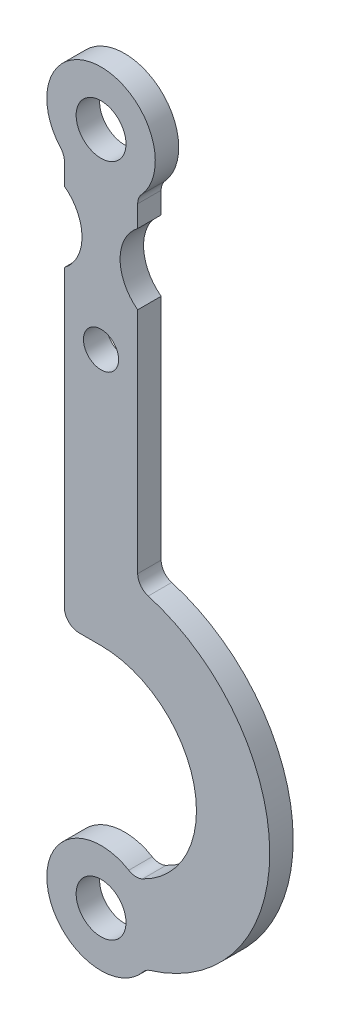
ISO-10303-21;
HEADER;
FILE_DESCRIPTION(('STEP AP214'),'2;1');
FILE_NAME('part.step','',(''),(''),'','','');
FILE_SCHEMA(('AUTOMOTIVE_DESIGN { 1 0 10303 214 1 1 1 1 }'));
ENDSEC;
DATA;
#1=APPLICATION_CONTEXT('core data for automotive mechanical design processes');
#2=APPLICATION_PROTOCOL_DEFINITION('international standard','automotive_design',2000,#1);
#3=PRODUCT_CONTEXT('',#1,'mechanical');
#4=PRODUCT('Part','Part','',(#3));
#5=PRODUCT_RELATED_PRODUCT_CATEGORY('part','',(#4));
#6=PRODUCT_DEFINITION_FORMATION('','',#4);
#7=PRODUCT_DEFINITION_CONTEXT('part definition',#1,'design');
#8=PRODUCT_DEFINITION('design','',#6,#7);
#9=PRODUCT_DEFINITION_SHAPE('','',#8);
#10=(LENGTH_UNIT() NAMED_UNIT(*) SI_UNIT(.MILLI.,.METRE.));
#11=(NAMED_UNIT(*) PLANE_ANGLE_UNIT() SI_UNIT($,.RADIAN.));
#12=(NAMED_UNIT(*) SI_UNIT($,.STERADIAN.) SOLID_ANGLE_UNIT());
#13=UNCERTAINTY_MEASURE_WITH_UNIT(LENGTH_MEASURE(1.E-05),#10,'distance_accuracy_value','');
#14=(GEOMETRIC_REPRESENTATION_CONTEXT(3) GLOBAL_UNCERTAINTY_ASSIGNED_CONTEXT((#13)) GLOBAL_UNIT_ASSIGNED_CONTEXT((#10,
#11,#12)) REPRESENTATION_CONTEXT('',''));
#15=CARTESIAN_POINT('',(0.,0.,0.));
#16=DIRECTION('',(0.,0.,1.));
#17=DIRECTION('',(1.,0.,0.));
#18=AXIS2_PLACEMENT_3D('',#15,#16,#17);
#19=CARTESIAN_POINT('',(0.,-230.,8.));
#20=DIRECTION('',(0.,0.,-1.));
#21=DIRECTION('',(-1.,0.,0.));
#22=AXIS2_PLACEMENT_3D('',#19,#20,#21);
#23=CYLINDRICAL_SURFACE('',#22,18.5);
#24=CARTESIAN_POINT('',(0.,-230.,0.));
#25=DIRECTION('',(0.,0.,1.));
#26=DIRECTION('',(1.,0.,0.));
#27=AXIS2_PLACEMENT_3D('',#24,#25,#26);
#28=CIRCLE('',#27,18.5);
#29=CARTESIAN_POINT('',(9.44463891587366,-214.092492472145,0.));
#30=VERTEX_POINT('',#29);
#31=CARTESIAN_POINT('',(14.3530284553606,-241.672213764304,0.));
#32=VERTEX_POINT('',#31);
#33=EDGE_CURVE('E220',#30,#32,#28,.T.);
#34=ORIENTED_EDGE('',*,*,#33,.T.);
#35=DIRECTION('',(0.,0.,-1.));
#36=VECTOR('',#35,1.);
#37=CARTESIAN_POINT('',(14.3530284553606,-241.672213764304,8.));
#38=LINE('',#37,#36);
#39=CARTESIAN_POINT('',(14.3530284553606,-241.672213764304,8.));
#40=VERTEX_POINT('',#39);
#41=EDGE_CURVE('E261',#32,#40,#38,.F.);
#42=ORIENTED_EDGE('',*,*,#41,.T.);
#43=CARTESIAN_POINT('',(0.,-230.,8.));
#44=DIRECTION('',(0.,0.,1.));
#45=DIRECTION('',(1.,0.,0.));
#46=AXIS2_PLACEMENT_3D('',#43,#44,#45);
#47=CIRCLE('',#46,18.5);
#48=CARTESIAN_POINT('',(9.44463891587366,-214.092492472145,8.));
#49=VERTEX_POINT('',#48);
#50=EDGE_CURVE('E387',#49,#40,#47,.T.);
#51=ORIENTED_EDGE('',*,*,#50,.F.);
#52=DIRECTION('',(0.,0.,-1.));
#53=VECTOR('',#52,1.);
#54=CARTESIAN_POINT('',(9.44463891587366,-214.092492472145,8.));
#55=LINE('',#54,#53);
#56=EDGE_CURVE('E258',#49,#30,#55,.T.);
#57=ORIENTED_EDGE('',*,*,#56,.T.);
#58=EDGE_LOOP('',(#34,#42,#51,#57));
#59=FACE_BOUND('',#58,.T.);
#60=ADVANCED_FACE('F43',(#59),#23,.T.);
#61=CARTESIAN_POINT('',(0.,-185.,8.));
#62=DIRECTION('',(0.,0.,-1.));
#63=DIRECTION('',(-1.,0.,0.));
#64=AXIS2_PLACEMENT_3D('',#61,#62,#63);
#65=CYLINDRICAL_SURFACE('',#64,57.5433285968466);
#66=CARTESIAN_POINT('',(0.,-185.,8.));
#67=DIRECTION('',(0.,0.,1.));
#68=DIRECTION('',(1.,0.,0.));
#69=AXIS2_PLACEMENT_3D('',#66,#67,#68);
#70=CIRCLE('',#69,57.5433285968466);
#71=CARTESIAN_POINT('',(16.7746577780857,-240.044032577862,8.));
#72=VERTEX_POINT('',#71);
#73=CARTESIAN_POINT('',(16.1009698881871,-129.755150152577,8.));
#74=VERTEX_POINT('',#73);
#75=EDGE_CURVE('E185',#72,#74,#70,.T.);
#76=ORIENTED_EDGE('',*,*,#75,.F.);
#77=DIRECTION('',(0.,0.,-1.));
#78=VECTOR('',#77,1.);
#79=CARTESIAN_POINT('',(16.7746577780857,-240.044032577862,8.));
#80=LINE('',#79,#78);
#81=CARTESIAN_POINT('',(16.7746577780857,-240.044032577862,0.));
#82=VERTEX_POINT('',#81);
#83=EDGE_CURVE('E255',#72,#82,#80,.T.);
#84=ORIENTED_EDGE('',*,*,#83,.T.);
#85=CARTESIAN_POINT('',(0.,-185.,0.));
#86=DIRECTION('',(0.,0.,1.));
#87=DIRECTION('',(1.,0.,0.));
#88=AXIS2_PLACEMENT_3D('',#85,#86,#87);
#89=CIRCLE('',#88,57.5433285968466);
#90=CARTESIAN_POINT('',(16.1009698881871,-129.755150152577,0.));
#91=VERTEX_POINT('',#90);
#92=EDGE_CURVE('E223',#82,#91,#89,.T.);
#93=ORIENTED_EDGE('',*,*,#92,.T.);
#94=DIRECTION('',(0.,0.,-1.));
#95=VECTOR('',#94,1.);
#96=CARTESIAN_POINT('',(16.1009698881871,-129.755150152577,8.));
#97=LINE('',#96,#95);
#98=EDGE_CURVE('E175',#91,#74,#97,.F.);
#99=ORIENTED_EDGE('',*,*,#98,.T.);
#100=EDGE_LOOP('',(#76,#84,#93,#99));
#101=FACE_BOUND('',#100,.T.);
#102=ADVANCED_FACE('F305',(#101),#65,.T.);
#103=CARTESIAN_POINT('',(12.5,0.,8.));
#104=DIRECTION('',(1.,0.,0.));
#105=DIRECTION('',(0.,1.,0.));
#106=AXIS2_PLACEMENT_3D('',#103,#104,#105);
#107=PLANE('',#106);
#108=DIRECTION('',(0.,-1.,0.));
#109=VECTOR('',#108,1.);
#110=CARTESIAN_POINT('',(12.5,0.,8.));
#111=LINE('',#110,#109);
#112=CARTESIAN_POINT('',(12.5,-47.,8.));
#113=VERTEX_POINT('',#112);
#114=CARTESIAN_POINT('',(12.5,-124.954867374839,8.));
#115=VERTEX_POINT('',#114);
#116=EDGE_CURVE('E167',#113,#115,#111,.T.);
#117=ORIENTED_EDGE('',*,*,#116,.T.);
#118=DIRECTION('',(0.,0.,-1.));
#119=VECTOR('',#118,1.);
#120=CARTESIAN_POINT('',(12.5,-124.954867374839,8.));
#121=LINE('',#120,#119);
#122=CARTESIAN_POINT('',(12.5,-124.954867374839,0.));
#123=VERTEX_POINT('',#122);
#124=EDGE_CURVE('E275',#115,#123,#121,.T.);
#125=ORIENTED_EDGE('',*,*,#124,.T.);
#126=DIRECTION('',(0.,-1.,0.));
#127=VECTOR('',#126,1.);
#128=CARTESIAN_POINT('',(12.5,0.,0.));
#129=LINE('',#128,#127);
#130=CARTESIAN_POINT('',(12.5,-47.,0.));
#131=VERTEX_POINT('',#130);
#132=EDGE_CURVE('E170',#131,#123,#129,.T.);
#133=ORIENTED_EDGE('',*,*,#132,.F.);
#134=DIRECTION('',(0.,0.,-1.));
#135=VECTOR('',#134,1.);
#136=CARTESIAN_POINT('',(12.5,-47.,8.));
#137=LINE('',#136,#135);
#138=EDGE_CURVE('E163',#113,#131,#137,.T.);
#139=ORIENTED_EDGE('',*,*,#138,.F.);
#140=EDGE_LOOP('',(#117,#125,#133,#139));
#141=FACE_BOUND('',#140,.T.);
#142=ADVANCED_FACE('F165',(#141),#107,.T.);
#143=CARTESIAN_POINT('',(21.5,-35.,8.));
#144=DIRECTION('',(0.,0.,-1.));
#145=DIRECTION('',(-1.,0.,0.));
#146=AXIS2_PLACEMENT_3D('',#143,#144,#145);
#147=CYLINDRICAL_SURFACE('',#146,15.);
#148=CARTESIAN_POINT('',(21.5,-35.,0.));
#149=DIRECTION('',(0.,0.,1.));
#150=DIRECTION('',(1.,0.,0.));
#151=AXIS2_PLACEMENT_3D('',#148,#149,#150);
#152=CIRCLE('',#151,15.);
#153=CARTESIAN_POINT('',(12.5,-23.,0.));
#154=VERTEX_POINT('',#153);
#155=EDGE_CURVE('E227',#154,#131,#152,.T.);
#156=ORIENTED_EDGE('',*,*,#155,.F.);
#157=DIRECTION('',(0.,0.,-1.));
#158=VECTOR('',#157,1.);
#159=CARTESIAN_POINT('',(12.5,-23.,8.));
#160=LINE('',#159,#158);
#161=CARTESIAN_POINT('',(12.5,-23.,8.));
#162=VERTEX_POINT('',#161);
#163=EDGE_CURVE('E176',#162,#154,#160,.T.);
#164=ORIENTED_EDGE('',*,*,#163,.F.);
#165=CARTESIAN_POINT('',(21.5,-35.,8.));
#166=DIRECTION('',(0.,0.,1.));
#167=DIRECTION('',(1.,0.,0.));
#168=AXIS2_PLACEMENT_3D('',#165,#166,#167);
#169=CIRCLE('',#168,15.);
#170=EDGE_CURVE('E182',#162,#113,#169,.T.);
#171=ORIENTED_EDGE('',*,*,#170,.T.);
#172=ORIENTED_EDGE('',*,*,#138,.T.);
#173=EDGE_LOOP('',(#156,#164,#171,#172));
#174=FACE_BOUND('',#173,.T.);
#175=ADVANCED_FACE('F188',(#174),#147,.F.);
#176=CARTESIAN_POINT('',(12.5,0.,8.));
#177=DIRECTION('',(1.,0.,0.));
#178=DIRECTION('',(0.,1.,0.));
#179=AXIS2_PLACEMENT_3D('',#176,#177,#178);
#180=PLANE('',#179);
#181=DIRECTION('',(0.,-1.,0.));
#182=VECTOR('',#181,1.);
#183=CARTESIAN_POINT('',(12.5,0.,0.));
#184=LINE('',#183,#182);
#185=CARTESIAN_POINT('',(12.5,-15.6843871413581,0.));
#186=VERTEX_POINT('',#185);
#187=EDGE_CURVE('E229',#186,#154,#184,.T.);
#188=ORIENTED_EDGE('',*,*,#187,.F.);
#189=DIRECTION('',(0.,0.,1.));
#190=VECTOR('',#189,1.);
#191=CARTESIAN_POINT('',(12.5,-15.6843871413581,8.));
#192=LINE('',#191,#190);
#193=CARTESIAN_POINT('',(12.5,-15.6843871413581,8.));
#194=VERTEX_POINT('',#193);
#195=EDGE_CURVE('E270',#186,#194,#192,.T.);
#196=ORIENTED_EDGE('',*,*,#195,.T.);
#197=DIRECTION('',(0.,-1.,0.));
#198=VECTOR('',#197,1.);
#199=CARTESIAN_POINT('',(12.5,0.,8.));
#200=LINE('',#199,#198);
#201=EDGE_CURVE('E190',#194,#162,#200,.T.);
#202=ORIENTED_EDGE('',*,*,#201,.T.);
#203=ORIENTED_EDGE('',*,*,#163,.T.);
#204=EDGE_LOOP('',(#188,#196,#202,#203));
#205=FACE_BOUND('',#204,.T.);
#206=ADVANCED_FACE('F431',(#205),#180,.T.);
#207=CARTESIAN_POINT('',(0.,0.,8.));
#208=DIRECTION('',(0.,0.,-1.));
#209=DIRECTION('',(-1.,0.,0.));
#210=AXIS2_PLACEMENT_3D('',#207,#208,#209);
#211=CYLINDRICAL_SURFACE('',#210,18.5);
#212=CARTESIAN_POINT('',(0.,0.,8.));
#213=DIRECTION('',(0.,0.,1.));
#214=DIRECTION('',(1.,0.,0.));
#215=AXIS2_PLACEMENT_3D('',#212,#213,#214);
#216=CIRCLE('',#215,18.5);
#217=CARTESIAN_POINT('',(-13.7765957446809,-12.3472834942607,8.));
#218=VERTEX_POINT('',#217);
#219=CARTESIAN_POINT('',(13.7765957446809,-12.3472834942607,8.));
#220=VERTEX_POINT('',#219);
#221=EDGE_CURVE('E192',#218,#220,#216,.F.);
#222=ORIENTED_EDGE('',*,*,#221,.T.);
#223=DIRECTION('',(0.,0.,-1.));
#224=VECTOR('',#223,1.);
#225=CARTESIAN_POINT('',(13.7765957446809,-12.3472834942607,8.));
#226=LINE('',#225,#224);
#227=CARTESIAN_POINT('',(13.7765957446809,-12.3472834942607,0.));
#228=VERTEX_POINT('',#227);
#229=EDGE_CURVE('E267',#220,#228,#226,.T.);
#230=ORIENTED_EDGE('',*,*,#229,.T.);
#231=CARTESIAN_POINT('',(0.,0.,0.));
#232=DIRECTION('',(0.,0.,1.));
#233=DIRECTION('',(1.,0.,0.));
#234=AXIS2_PLACEMENT_3D('',#231,#232,#233);
#235=CIRCLE('',#234,18.5);
#236=CARTESIAN_POINT('',(-13.7765957446809,-12.3472834942607,0.));
#237=VERTEX_POINT('',#236);
#238=EDGE_CURVE('E231',#237,#228,#235,.F.);
#239=ORIENTED_EDGE('',*,*,#238,.F.);
#240=DIRECTION('',(0.,0.,-1.));
#241=VECTOR('',#240,1.);
#242=CARTESIAN_POINT('',(-13.7765957446809,-12.3472834942607,8.));
#243=LINE('',#242,#241);
#244=EDGE_CURVE('E265',#237,#218,#243,.F.);
#245=ORIENTED_EDGE('',*,*,#244,.T.);
#246=EDGE_LOOP('',(#222,#230,#239,#245));
#247=FACE_BOUND('',#246,.T.);
#248=ADVANCED_FACE('F359',(#247),#211,.T.);
#249=CARTESIAN_POINT('',(-12.5,0.,8.));
#250=DIRECTION('',(1.,0.,0.));
#251=DIRECTION('',(0.,1.,0.));
#252=AXIS2_PLACEMENT_3D('',#249,#250,#251);
#253=PLANE('',#252);
#254=DIRECTION('',(0.,-1.,0.));
#255=VECTOR('',#254,1.);
#256=CARTESIAN_POINT('',(-12.5,0.,8.));
#257=LINE('',#256,#255);
#258=CARTESIAN_POINT('',(-12.5,-15.6843871413581,8.));
#259=VERTEX_POINT('',#258);
#260=CARTESIAN_POINT('',(-12.5,-23.,8.));
#261=VERTEX_POINT('',#260);
#262=EDGE_CURVE('E198',#259,#261,#257,.T.);
#263=ORIENTED_EDGE('',*,*,#262,.F.);
#264=DIRECTION('',(0.,0.,-1.));
#265=VECTOR('',#264,1.);
#266=CARTESIAN_POINT('',(-12.5,-15.6843871413581,8.));
#267=LINE('',#266,#265);
#268=CARTESIAN_POINT('',(-12.5,-15.6843871413581,0.));
#269=VERTEX_POINT('',#268);
#270=EDGE_CURVE('E272',#259,#269,#267,.T.);
#271=ORIENTED_EDGE('',*,*,#270,.T.);
#272=DIRECTION('',(0.,-1.,0.));
#273=VECTOR('',#272,1.);
#274=CARTESIAN_POINT('',(-12.5,0.,0.));
#275=LINE('',#274,#273);
#276=CARTESIAN_POINT('',(-12.5,-23.,0.));
#277=VERTEX_POINT('',#276);
#278=EDGE_CURVE('E234',#269,#277,#275,.T.);
#279=ORIENTED_EDGE('',*,*,#278,.T.);
#280=DIRECTION('',(0.,0.,-1.));
#281=VECTOR('',#280,1.);
#282=CARTESIAN_POINT('',(-12.5,-23.,8.));
#283=LINE('',#282,#281);
#284=EDGE_CURVE('E250',#261,#277,#283,.T.);
#285=ORIENTED_EDGE('',*,*,#284,.F.);
#286=EDGE_LOOP('',(#263,#271,#279,#285));
#287=FACE_BOUND('',#286,.T.);
#288=ADVANCED_FACE('F366',(#287),#253,.F.);
#289=CARTESIAN_POINT('',(-21.5,-35.,8.));
#290=DIRECTION('',(0.,0.,-1.));
#291=DIRECTION('',(-1.,0.,0.));
#292=AXIS2_PLACEMENT_3D('',#289,#290,#291);
#293=CYLINDRICAL_SURFACE('',#292,15.);
#294=CARTESIAN_POINT('',(-21.5,-35.,0.));
#295=DIRECTION('',(0.,0.,1.));
#296=DIRECTION('',(1.,0.,0.));
#297=AXIS2_PLACEMENT_3D('',#294,#295,#296);
#298=CIRCLE('',#297,15.);
#299=CARTESIAN_POINT('',(-12.5,-47.,0.));
#300=VERTEX_POINT('',#299);
#301=EDGE_CURVE('E236',#277,#300,#298,.F.);
#302=ORIENTED_EDGE('',*,*,#301,.T.);
#303=DIRECTION('',(0.,0.,-1.));
#304=VECTOR('',#303,1.);
#305=CARTESIAN_POINT('',(-12.5,-47.,8.));
#306=LINE('',#305,#304);
#307=CARTESIAN_POINT('',(-12.5,-47.,8.));
#308=VERTEX_POINT('',#307);
#309=EDGE_CURVE('E247',#308,#300,#306,.T.);
#310=ORIENTED_EDGE('',*,*,#309,.F.);
#311=CARTESIAN_POINT('',(-21.5,-35.,8.));
#312=DIRECTION('',(0.,0.,1.));
#313=DIRECTION('',(1.,0.,0.));
#314=AXIS2_PLACEMENT_3D('',#311,#312,#313);
#315=CIRCLE('',#314,15.);
#316=EDGE_CURVE('E200',#261,#308,#315,.F.);
#317=ORIENTED_EDGE('',*,*,#316,.F.);
#318=ORIENTED_EDGE('',*,*,#284,.T.);
#319=EDGE_LOOP('',(#302,#310,#317,#318));
#320=FACE_BOUND('',#319,.T.);
#321=ADVANCED_FACE('F372',(#320),#293,.F.);
#322=CARTESIAN_POINT('',(-12.5,0.,8.));
#323=DIRECTION('',(1.,0.,0.));
#324=DIRECTION('',(0.,1.,0.));
#325=AXIS2_PLACEMENT_3D('',#322,#323,#324);
#326=PLANE('',#325);
#327=DIRECTION('',(0.,-1.,0.));
#328=VECTOR('',#327,1.);
#329=CARTESIAN_POINT('',(-12.5,0.,0.));
#330=LINE('',#329,#328);
#331=CARTESIAN_POINT('',(-12.5,-147.456671403153,0.));
#332=VERTEX_POINT('',#331);
#333=EDGE_CURVE('E238',#300,#332,#330,.T.);
#334=ORIENTED_EDGE('',*,*,#333,.T.);
#335=DIRECTION('',(0.,0.,-1.));
#336=VECTOR('',#335,1.);
#337=CARTESIAN_POINT('',(-12.5,-147.456671403153,8.));
#338=LINE('',#337,#336);
#339=CARTESIAN_POINT('',(-12.5,-147.456671403153,8.));
#340=VERTEX_POINT('',#339);
#341=EDGE_CURVE('E58',#332,#340,#338,.F.);
#342=ORIENTED_EDGE('',*,*,#341,.T.);
#343=DIRECTION('',(0.,-1.,0.));
#344=VECTOR('',#343,1.);
#345=CARTESIAN_POINT('',(-12.5,0.,8.));
#346=LINE('',#345,#344);
#347=EDGE_CURVE('E202',#308,#340,#346,.T.);
#348=ORIENTED_EDGE('',*,*,#347,.F.);
#349=ORIENTED_EDGE('',*,*,#309,.T.);
#350=EDGE_LOOP('',(#334,#342,#348,#349));
#351=FACE_BOUND('',#350,.T.);
#352=ADVANCED_FACE('F422',(#351),#326,.F.);
#353=CARTESIAN_POINT('',(0.,-152.456671403153,8.));
#354=DIRECTION('',(0.,-1.,0.));
#355=DIRECTION('',(0.,0.,-1.));
#356=AXIS2_PLACEMENT_3D('',#353,#354,#355);
#357=PLANE('',#356);
#358=DIRECTION('',(-1.,0.,0.));
#359=VECTOR('',#358,1.);
#360=CARTESIAN_POINT('',(0.,-152.456671403153,8.));
#361=LINE('',#360,#359);
#362=CARTESIAN_POINT('',(0.,-152.456671403153,8.));
#363=VERTEX_POINT('',#362);
#364=CARTESIAN_POINT('',(-7.49999999999999,-152.456671403153,8.));
#365=VERTEX_POINT('',#364);
#366=EDGE_CURVE('E204',#363,#365,#361,.T.);
#367=ORIENTED_EDGE('',*,*,#366,.T.);
#368=DIRECTION('',(0.,0.,-1.));
#369=VECTOR('',#368,1.);
#370=CARTESIAN_POINT('',(-7.49999999999999,-152.456671403153,0.));
#371=LINE('',#370,#369);
#372=CARTESIAN_POINT('',(-7.49999999999999,-152.456671403153,0.));
#373=VERTEX_POINT('',#372);
#374=EDGE_CURVE('E277',#365,#373,#371,.T.);
#375=ORIENTED_EDGE('',*,*,#374,.T.);
#376=DIRECTION('',(-1.,0.,0.));
#377=VECTOR('',#376,1.);
#378=CARTESIAN_POINT('',(0.,-152.456671403153,0.));
#379=LINE('',#378,#377);
#380=CARTESIAN_POINT('',(0.,-152.456671403153,0.));
#381=VERTEX_POINT('',#380);
#382=EDGE_CURVE('E240',#381,#373,#379,.T.);
#383=ORIENTED_EDGE('',*,*,#382,.F.);
#384=DIRECTION('',(0.,0.,-1.));
#385=VECTOR('',#384,1.);
#386=CARTESIAN_POINT('',(0.,-152.456671403153,8.));
#387=LINE('',#386,#385);
#388=EDGE_CURVE('E210',#363,#381,#387,.T.);
#389=ORIENTED_EDGE('',*,*,#388,.F.);
#390=EDGE_LOOP('',(#367,#375,#383,#389));
#391=FACE_BOUND('',#390,.T.);
#392=ADVANCED_FACE('F332',(#391),#357,.T.);
#393=CARTESIAN_POINT('',(0.,0.,8.));
#394=DIRECTION('',(0.,0.,-1.));
#395=DIRECTION('',(-1.,0.,0.));
#396=AXIS2_PLACEMENT_3D('',#393,#394,#395);
#397=CYLINDRICAL_SURFACE('',#396,8.5);
#398=CARTESIAN_POINT('',(0.,0.,8.));
#399=DIRECTION('',(0.,0.,1.));
#400=DIRECTION('',(1.,0.,0.));
#401=AXIS2_PLACEMENT_3D('',#398,#399,#400);
#402=CIRCLE('',#401,8.5);
#403=CARTESIAN_POINT('',(8.5,0.,8.));
#404=VERTEX_POINT('',#403);
#405=EDGE_CURVE('E390',#404,#404,#402,.T.);
#406=ORIENTED_EDGE('',*,*,#405,.T.);
#407=EDGE_LOOP('',(#406));
#408=FACE_BOUND('',#407,.T.);
#409=CARTESIAN_POINT('',(0.,0.,0.));
#410=DIRECTION('',(0.,0.,1.));
#411=DIRECTION('',(1.,0.,0.));
#412=AXIS2_PLACEMENT_3D('',#409,#410,#411);
#413=CIRCLE('',#412,8.5);
#414=CARTESIAN_POINT('',(8.5,0.,0.));
#415=VERTEX_POINT('',#414);
#416=EDGE_CURVE('E217',#415,#415,#413,.T.);
#417=ORIENTED_EDGE('',*,*,#416,.F.);
#418=EDGE_LOOP('',(#417));
#419=FACE_BOUND('',#418,.T.);
#420=ADVANCED_FACE('F328',(#408,#419),#397,.F.);
#421=CARTESIAN_POINT('',(0.,-230.,8.));
#422=DIRECTION('',(0.,0.,-1.));
#423=DIRECTION('',(-1.,0.,0.));
#424=AXIS2_PLACEMENT_3D('',#421,#422,#423);
#425=CYLINDRICAL_SURFACE('',#424,8.50000000000001);
#426=CARTESIAN_POINT('',(0.,-230.,8.));
#427=DIRECTION('',(0.,0.,1.));
#428=DIRECTION('',(1.,0.,0.));
#429=AXIS2_PLACEMENT_3D('',#426,#427,#428);
#430=CIRCLE('',#429,8.50000000000001);
#431=CARTESIAN_POINT('',(8.50000000000001,-230.,8.));
#432=VERTEX_POINT('',#431);
#433=EDGE_CURVE('E393',#432,#432,#430,.T.);
#434=ORIENTED_EDGE('',*,*,#433,.T.);
#435=EDGE_LOOP('',(#434));
#436=FACE_BOUND('',#435,.T.);
#437=CARTESIAN_POINT('',(0.,-230.,0.));
#438=DIRECTION('',(0.,0.,1.));
#439=DIRECTION('',(1.,0.,0.));
#440=AXIS2_PLACEMENT_3D('',#437,#438,#439);
#441=CIRCLE('',#440,8.50000000000001);
#442=CARTESIAN_POINT('',(8.50000000000001,-230.,0.));
#443=VERTEX_POINT('',#442);
#444=EDGE_CURVE('E214',#443,#443,#441,.T.);
#445=ORIENTED_EDGE('',*,*,#444,.F.);
#446=EDGE_LOOP('',(#445));
#447=FACE_BOUND('',#446,.T.);
#448=ADVANCED_FACE('F331',(#436,#447),#425,.F.);
#449=CARTESIAN_POINT('',(0.,-65.,8.));
#450=DIRECTION('',(0.,0.,-1.));
#451=DIRECTION('',(-1.,0.,0.));
#452=AXIS2_PLACEMENT_3D('',#449,#450,#451);
#453=CYLINDRICAL_SURFACE('',#452,6.);
#454=CARTESIAN_POINT('',(0.,-65.,8.));
#455=DIRECTION('',(0.,0.,1.));
#456=DIRECTION('',(1.,0.,0.));
#457=AXIS2_PLACEMENT_3D('',#454,#455,#456);
#458=CIRCLE('',#457,6.);
#459=CARTESIAN_POINT('',(6.,-65.,8.));
#460=VERTEX_POINT('',#459);
#461=EDGE_CURVE('E245',#460,#460,#458,.T.);
#462=ORIENTED_EDGE('',*,*,#461,.T.);
#463=EDGE_LOOP('',(#462));
#464=FACE_BOUND('',#463,.T.);
#465=CARTESIAN_POINT('',(0.,-65.,0.));
#466=DIRECTION('',(0.,0.,1.));
#467=DIRECTION('',(1.,0.,0.));
#468=AXIS2_PLACEMENT_3D('',#465,#466,#467);
#469=CIRCLE('',#468,6.);
#470=CARTESIAN_POINT('',(6.,-65.,0.));
#471=VERTEX_POINT('',#470);
#472=EDGE_CURVE('E211',#471,#471,#469,.T.);
#473=ORIENTED_EDGE('',*,*,#472,.F.);
#474=EDGE_LOOP('',(#473));
#475=FACE_BOUND('',#474,.T.);
#476=ADVANCED_FACE('F336',(#464,#475),#453,.F.);
#477=CARTESIAN_POINT('',(0.,-185.,8.));
#478=DIRECTION('',(0.,0.,-1.));
#479=DIRECTION('',(-1.,0.,0.));
#480=AXIS2_PLACEMENT_3D('',#477,#478,#479);
#481=CYLINDRICAL_SURFACE('',#480,32.5433285968467);
#482=CARTESIAN_POINT('',(0.,-185.,0.));
#483=DIRECTION('',(0.,0.,1.));
#484=DIRECTION('',(1.,0.,0.));
#485=AXIS2_PLACEMENT_3D('',#482,#483,#484);
#486=CIRCLE('',#485,32.5433285968467);
#487=CARTESIAN_POINT('',(14.1751296796172,-214.293923170657,0.));
#488=VERTEX_POINT('',#487);
#489=EDGE_CURVE('E242',#381,#488,#486,.F.);
#490=ORIENTED_EDGE('',*,*,#489,.T.);
#491=DIRECTION('',(0.,0.,-1.));
#492=VECTOR('',#491,1.);
#493=CARTESIAN_POINT('',(14.1751296796172,-214.293923170657,8.));
#494=LINE('',#493,#492);
#495=CARTESIAN_POINT('',(14.1751296796172,-214.293923170657,8.));
#496=VERTEX_POINT('',#495);
#497=EDGE_CURVE('E263',#488,#496,#494,.F.);
#498=ORIENTED_EDGE('',*,*,#497,.T.);
#499=CARTESIAN_POINT('',(0.,-185.,8.));
#500=DIRECTION('',(0.,0.,1.));
#501=DIRECTION('',(1.,0.,0.));
#502=AXIS2_PLACEMENT_3D('',#499,#500,#501);
#503=CIRCLE('',#502,32.5433285968467);
#504=EDGE_CURVE('E207',#363,#496,#503,.F.);
#505=ORIENTED_EDGE('',*,*,#504,.F.);
#506=ORIENTED_EDGE('',*,*,#388,.T.);
#507=EDGE_LOOP('',(#490,#498,#505,#506));
#508=FACE_BOUND('',#507,.T.);
#509=ADVANCED_FACE('F339',(#508),#481,.F.);
#510=CARTESIAN_POINT('',(0.,0.,8.));
#511=DIRECTION('',(0.,0.,1.));
#512=DIRECTION('',(1.,0.,0.));
#513=AXIS2_PLACEMENT_3D('',#510,#511,#512);
#514=PLANE('',#513);
#515=ORIENTED_EDGE('',*,*,#461,.F.);
#516=EDGE_LOOP('',(#515));
#517=FACE_BOUND('',#516,.T.);
#518=ORIENTED_EDGE('',*,*,#433,.F.);
#519=EDGE_LOOP('',(#518));
#520=FACE_BOUND('',#519,.T.);
#521=ORIENTED_EDGE('',*,*,#405,.F.);
#522=EDGE_LOOP('',(#521));
#523=FACE_BOUND('',#522,.T.);
#524=ORIENTED_EDGE('',*,*,#347,.T.);
#525=CARTESIAN_POINT('',(-7.49999999999999,-147.456671403153,8.));
#526=DIRECTION('',(0.,0.,1.));
#527=DIRECTION('',(1.,0.,0.));
#528=AXIS2_PLACEMENT_3D('',#525,#526,#527);
#529=CIRCLE('',#528,5.);
#530=EDGE_CURVE('E282',#340,#365,#529,.T.);
#531=ORIENTED_EDGE('',*,*,#530,.T.);
#532=ORIENTED_EDGE('',*,*,#366,.F.);
#533=ORIENTED_EDGE('',*,*,#504,.T.);
#534=CARTESIAN_POINT('',(11.997244028272,-209.793166113265,8.));
#535=DIRECTION('',(0.,0.,1.));
#536=DIRECTION('',(1.,0.,0.));
#537=AXIS2_PLACEMENT_3D('',#534,#535,#536);
#538=CIRCLE('',#537,5.);
#539=EDGE_CURVE('E290',#496,#49,#538,.F.);
#540=ORIENTED_EDGE('',*,*,#539,.T.);
#541=ORIENTED_EDGE('',*,*,#50,.T.);
#542=CARTESIAN_POINT('',(18.2322253351878,-244.826866133035,8.));
#543=DIRECTION('',(0.,0.,1.));
#544=DIRECTION('',(1.,0.,0.));
#545=AXIS2_PLACEMENT_3D('',#542,#543,#544);
#546=CIRCLE('',#545,5.);
#547=EDGE_CURVE('E286',#40,#72,#546,.F.);
#548=ORIENTED_EDGE('',*,*,#547,.T.);
#549=ORIENTED_EDGE('',*,*,#75,.T.);
#550=CARTESIAN_POINT('',(17.5,-124.954867374839,8.));
#551=DIRECTION('',(0.,0.,1.));
#552=DIRECTION('',(1.,0.,0.));
#553=AXIS2_PLACEMENT_3D('',#550,#551,#552);
#554=CIRCLE('',#553,5.);
#555=EDGE_CURVE('E11',#74,#115,#554,.F.);
#556=ORIENTED_EDGE('',*,*,#555,.T.);
#557=ORIENTED_EDGE('',*,*,#116,.F.);
#558=ORIENTED_EDGE('',*,*,#170,.F.);
#559=ORIENTED_EDGE('',*,*,#201,.F.);
#560=CARTESIAN_POINT('',(17.5,-15.6843871413581,8.));
#561=DIRECTION('',(0.,0.,1.));
#562=DIRECTION('',(1.,0.,0.));
#563=AXIS2_PLACEMENT_3D('',#560,#561,#562);
#564=CIRCLE('',#563,5.);
#565=EDGE_CURVE('E294',#194,#220,#564,.F.);
#566=ORIENTED_EDGE('',*,*,#565,.T.);
#567=ORIENTED_EDGE('',*,*,#221,.F.);
#568=CARTESIAN_POINT('',(-17.5,-15.6843871413581,8.));
#569=DIRECTION('',(0.,0.,1.));
#570=DIRECTION('',(1.,0.,0.));
#571=AXIS2_PLACEMENT_3D('',#568,#569,#570);
#572=CIRCLE('',#571,5.);
#573=EDGE_CURVE('E298',#218,#259,#572,.F.);
#574=ORIENTED_EDGE('',*,*,#573,.T.);
#575=ORIENTED_EDGE('',*,*,#262,.T.);
#576=ORIENTED_EDGE('',*,*,#316,.T.);
#577=EDGE_LOOP('',(#524,#531,#532,#533,#540,#541,#548,#549,#556,#557,#558,#559,#566,#567,#574,
#575,#576));
#578=FACE_BOUND('',#577,.T.);
#579=ADVANCED_FACE('F180',(#517,#520,#523,#578),#514,.T.);
#580=CARTESIAN_POINT('',(0.,0.,0.));
#581=DIRECTION('',(0.,0.,1.));
#582=DIRECTION('',(1.,0.,0.));
#583=AXIS2_PLACEMENT_3D('',#580,#581,#582);
#584=PLANE('',#583);
#585=ORIENTED_EDGE('',*,*,#472,.T.);
#586=EDGE_LOOP('',(#585));
#587=FACE_BOUND('',#586,.T.);
#588=ORIENTED_EDGE('',*,*,#444,.T.);
#589=EDGE_LOOP('',(#588));
#590=FACE_BOUND('',#589,.T.);
#591=ORIENTED_EDGE('',*,*,#416,.T.);
#592=EDGE_LOOP('',(#591));
#593=FACE_BOUND('',#592,.T.);
#594=ORIENTED_EDGE('',*,*,#382,.T.);
#595=CARTESIAN_POINT('',(-7.49999999999999,-147.456671403153,0.));
#596=DIRECTION('',(0.,0.,1.));
#597=DIRECTION('',(1.,0.,0.));
#598=AXIS2_PLACEMENT_3D('',#595,#596,#597);
#599=CIRCLE('',#598,5.);
#600=EDGE_CURVE('E66',#373,#332,#599,.F.);
#601=ORIENTED_EDGE('',*,*,#600,.T.);
#602=ORIENTED_EDGE('',*,*,#333,.F.);
#603=ORIENTED_EDGE('',*,*,#301,.F.);
#604=ORIENTED_EDGE('',*,*,#278,.F.);
#605=CARTESIAN_POINT('',(-17.5,-15.6843871413581,0.));
#606=DIRECTION('',(0.,0.,1.));
#607=DIRECTION('',(1.,0.,0.));
#608=AXIS2_PLACEMENT_3D('',#605,#606,#607);
#609=CIRCLE('',#608,5.);
#610=EDGE_CURVE('E296',#269,#237,#609,.T.);
#611=ORIENTED_EDGE('',*,*,#610,.T.);
#612=ORIENTED_EDGE('',*,*,#238,.T.);
#613=CARTESIAN_POINT('',(17.5,-15.6843871413581,0.));
#614=DIRECTION('',(0.,0.,1.));
#615=DIRECTION('',(1.,0.,0.));
#616=AXIS2_PLACEMENT_3D('',#613,#614,#615);
#617=CIRCLE('',#616,5.);
#618=EDGE_CURVE('E292',#228,#186,#617,.T.);
#619=ORIENTED_EDGE('',*,*,#618,.T.);
#620=ORIENTED_EDGE('',*,*,#187,.T.);
#621=ORIENTED_EDGE('',*,*,#155,.T.);
#622=ORIENTED_EDGE('',*,*,#132,.T.);
#623=CARTESIAN_POINT('',(17.5,-124.954867374839,0.));
#624=DIRECTION('',(0.,0.,1.));
#625=DIRECTION('',(1.,0.,0.));
#626=AXIS2_PLACEMENT_3D('',#623,#624,#625);
#627=CIRCLE('',#626,5.);
#628=EDGE_CURVE('E51',#123,#91,#627,.T.);
#629=ORIENTED_EDGE('',*,*,#628,.T.);
#630=ORIENTED_EDGE('',*,*,#92,.F.);
#631=CARTESIAN_POINT('',(18.2322253351878,-244.826866133035,0.));
#632=DIRECTION('',(0.,0.,1.));
#633=DIRECTION('',(1.,0.,0.));
#634=AXIS2_PLACEMENT_3D('',#631,#632,#633);
#635=CIRCLE('',#634,5.);
#636=EDGE_CURVE('E284',#82,#32,#635,.T.);
#637=ORIENTED_EDGE('',*,*,#636,.T.);
#638=ORIENTED_EDGE('',*,*,#33,.F.);
#639=CARTESIAN_POINT('',(11.997244028272,-209.793166113265,0.));
#640=DIRECTION('',(0.,0.,1.));
#641=DIRECTION('',(1.,0.,0.));
#642=AXIS2_PLACEMENT_3D('',#639,#640,#641);
#643=CIRCLE('',#642,5.);
#644=EDGE_CURVE('E288',#30,#488,#643,.T.);
#645=ORIENTED_EDGE('',*,*,#644,.T.);
#646=ORIENTED_EDGE('',*,*,#489,.F.);
#647=EDGE_LOOP('',(#594,#601,#602,#603,#604,#611,#612,#619,#620,#621,#622,#629,#630,#637,#638,
#645,#646));
#648=FACE_BOUND('',#647,.T.);
#649=ADVANCED_FACE('F300',(#587,#590,#593,#648),#584,.F.);
#650=CARTESIAN_POINT('',(18.2322253351878,-244.826866133035,8.));
#651=DIRECTION('',(0.,0.,1.));
#652=DIRECTION('',(1.,0.,0.));
#653=AXIS2_PLACEMENT_3D('',#650,#651,#652);
#654=CYLINDRICAL_SURFACE('',#653,5.);
#655=ORIENTED_EDGE('',*,*,#547,.F.);
#656=ORIENTED_EDGE('',*,*,#41,.F.);
#657=ORIENTED_EDGE('',*,*,#636,.F.);
#658=ORIENTED_EDGE('',*,*,#83,.F.);
#659=EDGE_LOOP('',(#655,#656,#657,#658));
#660=FACE_BOUND('',#659,.T.);
#661=ADVANCED_FACE('F341',(#660),#654,.F.);
#662=CARTESIAN_POINT('',(11.997244028272,-209.793166113265,8.));
#663=DIRECTION('',(0.,0.,-1.));
#664=DIRECTION('',(-1.,0.,0.));
#665=AXIS2_PLACEMENT_3D('',#662,#663,#664);
#666=CYLINDRICAL_SURFACE('',#665,5.);
#667=ORIENTED_EDGE('',*,*,#539,.F.);
#668=ORIENTED_EDGE('',*,*,#497,.F.);
#669=ORIENTED_EDGE('',*,*,#644,.F.);
#670=ORIENTED_EDGE('',*,*,#56,.F.);
#671=EDGE_LOOP('',(#667,#668,#669,#670));
#672=FACE_BOUND('',#671,.T.);
#673=ADVANCED_FACE('F344',(#672),#666,.F.);
#674=CARTESIAN_POINT('',(17.5,-15.6843871413581,8.));
#675=DIRECTION('',(0.,0.,-1.));
#676=DIRECTION('',(-1.,0.,0.));
#677=AXIS2_PLACEMENT_3D('',#674,#675,#676);
#678=CYLINDRICAL_SURFACE('',#677,5.);
#679=ORIENTED_EDGE('',*,*,#565,.F.);
#680=ORIENTED_EDGE('',*,*,#195,.F.);
#681=ORIENTED_EDGE('',*,*,#618,.F.);
#682=ORIENTED_EDGE('',*,*,#229,.F.);
#683=EDGE_LOOP('',(#679,#680,#681,#682));
#684=FACE_BOUND('',#683,.T.);
#685=ADVANCED_FACE('F315',(#684),#678,.F.);
#686=CARTESIAN_POINT('',(-17.5,-15.6843871413581,8.));
#687=DIRECTION('',(0.,0.,-1.));
#688=DIRECTION('',(-1.,0.,0.));
#689=AXIS2_PLACEMENT_3D('',#686,#687,#688);
#690=CYLINDRICAL_SURFACE('',#689,5.);
#691=ORIENTED_EDGE('',*,*,#573,.F.);
#692=ORIENTED_EDGE('',*,*,#244,.F.);
#693=ORIENTED_EDGE('',*,*,#610,.F.);
#694=ORIENTED_EDGE('',*,*,#270,.F.);
#695=EDGE_LOOP('',(#691,#692,#693,#694));
#696=FACE_BOUND('',#695,.T.);
#697=ADVANCED_FACE('F309',(#696),#690,.F.);
#698=CARTESIAN_POINT('',(17.5,-124.954867374839,8.));
#699=DIRECTION('',(0.,0.,-1.));
#700=DIRECTION('',(-1.,0.,0.));
#701=AXIS2_PLACEMENT_3D('',#698,#699,#700);
#702=CYLINDRICAL_SURFACE('',#701,5.);
#703=ORIENTED_EDGE('',*,*,#555,.F.);
#704=ORIENTED_EDGE('',*,*,#98,.F.);
#705=ORIENTED_EDGE('',*,*,#628,.F.);
#706=ORIENTED_EDGE('',*,*,#124,.F.);
#707=EDGE_LOOP('',(#703,#704,#705,#706));
#708=FACE_BOUND('',#707,.T.);
#709=ADVANCED_FACE('F307',(#708),#702,.F.);
#710=CARTESIAN_POINT('',(-7.49999999999999,-147.456671403153,8.));
#711=DIRECTION('',(0.,0.,1.));
#712=DIRECTION('',(1.,0.,0.));
#713=AXIS2_PLACEMENT_3D('',#710,#711,#712);
#714=CYLINDRICAL_SURFACE('',#713,5.);
#715=ORIENTED_EDGE('',*,*,#530,.F.);
#716=ORIENTED_EDGE('',*,*,#341,.F.);
#717=ORIENTED_EDGE('',*,*,#600,.F.);
#718=ORIENTED_EDGE('',*,*,#374,.F.);
#719=EDGE_LOOP('',(#715,#716,#717,#718));
#720=FACE_BOUND('',#719,.T.);
#721=ADVANCED_FACE('F45',(#720),#714,.T.);
#722=CLOSED_SHELL('',(#60,#102,#142,#175,#206,#248,#288,#321,#352,#392,#420,#448,#476,#509,#579,
#649,#661,#673,#685,#697,#709,#721));
#723=MANIFOLD_SOLID_BREP('B2',#722);
#724=ADVANCED_BREP_SHAPE_REPRESENTATION('',(#18,#723),#14);
#725=SHAPE_DEFINITION_REPRESENTATION(#9,#724);
ENDSEC;
END-ISO-10303-21;
